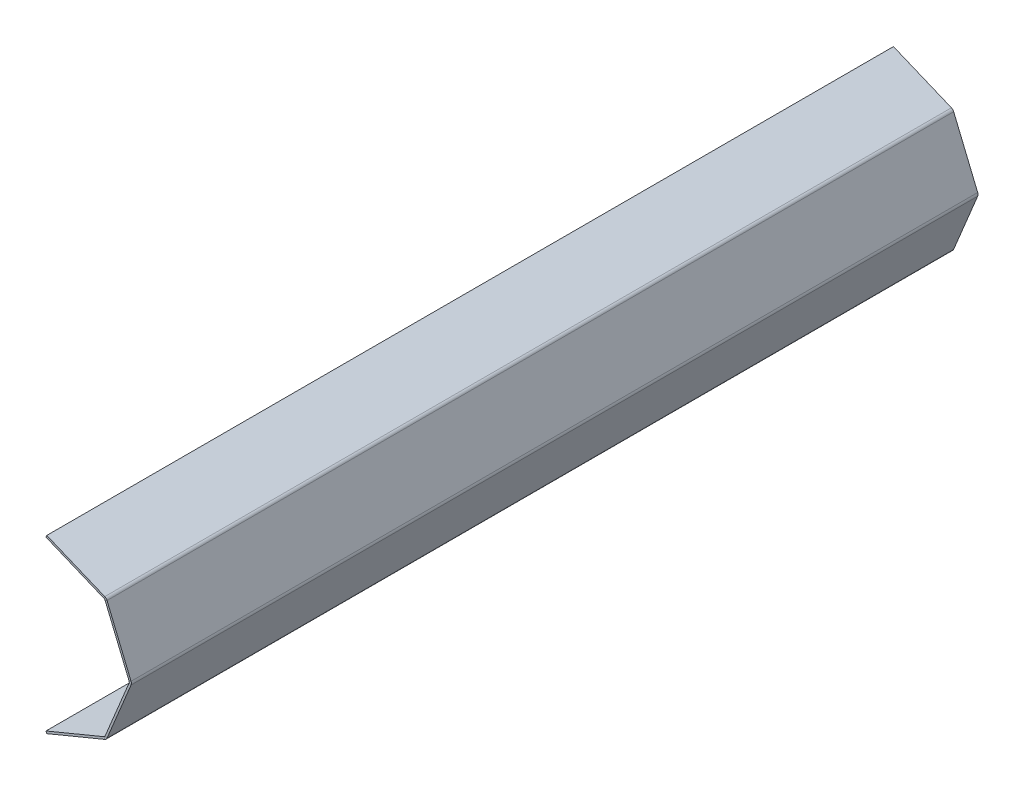
ISO-10303-21;
HEADER;
FILE_DESCRIPTION(('STEP AP214'),'2;1');
FILE_NAME('part.step','',(''),(''),'','','');
FILE_SCHEMA(('AUTOMOTIVE_DESIGN { 1 0 10303 214 1 1 1 1 }'));
ENDSEC;
DATA;
#1=APPLICATION_CONTEXT('core data for automotive mechanical design processes');
#2=APPLICATION_PROTOCOL_DEFINITION('international standard','automotive_design',2000,#1);
#3=PRODUCT_CONTEXT('',#1,'mechanical');
#4=PRODUCT('Part','Part','',(#3));
#5=PRODUCT_RELATED_PRODUCT_CATEGORY('part','',(#4));
#6=PRODUCT_DEFINITION_FORMATION('','',#4);
#7=PRODUCT_DEFINITION_CONTEXT('part definition',#1,'design');
#8=PRODUCT_DEFINITION('design','',#6,#7);
#9=PRODUCT_DEFINITION_SHAPE('','',#8);
#10=(LENGTH_UNIT() NAMED_UNIT(*) SI_UNIT(.MILLI.,.METRE.));
#11=(NAMED_UNIT(*) PLANE_ANGLE_UNIT() SI_UNIT($,.RADIAN.));
#12=(NAMED_UNIT(*) SI_UNIT($,.STERADIAN.) SOLID_ANGLE_UNIT());
#13=UNCERTAINTY_MEASURE_WITH_UNIT(LENGTH_MEASURE(1.E-05),#10,'distance_accuracy_value','');
#14=(GEOMETRIC_REPRESENTATION_CONTEXT(3) GLOBAL_UNCERTAINTY_ASSIGNED_CONTEXT((#13)) GLOBAL_UNIT_ASSIGNED_CONTEXT((#10,
#11,#12)) REPRESENTATION_CONTEXT('',''));
#15=CARTESIAN_POINT('',(0.,0.,0.));
#16=DIRECTION('',(0.,0.,1.));
#17=DIRECTION('',(1.,0.,0.));
#18=AXIS2_PLACEMENT_3D('',#15,#16,#17);
#19=CARTESIAN_POINT('',(139.507939075484,142.213919576215,2010.));
#20=DIRECTION('',(0.,0.,1.));
#21=DIRECTION('',(1.,0.,0.));
#22=AXIS2_PLACEMENT_3D('',#19,#20,#21);
#23=PLANE('',#22);
#24=DIRECTION('',(0.382683432365087,0.923879532511288,0.));
#25=VECTOR('',#24,1.);
#26=CARTESIAN_POINT('',(139.507939075484,142.213919576215,2010.));
#27=LINE('',#26,#25);
#28=CARTESIAN_POINT('',(139.507939075484,142.213919576215,2010.));
#29=VERTEX_POINT('',#28);
#30=CARTESIAN_POINT('',(141.42135623731,146.833317238771,2010.));
#31=VERTEX_POINT('',#30);
#32=EDGE_CURVE('E11',#29,#31,#27,.T.);
#33=ORIENTED_EDGE('',*,*,#32,.F.);
#34=CARTESIAN_POINT('',(137.594521913659,137.594521913659,2010.));
#35=DIRECTION('',(0.,0.,1.));
#36=DIRECTION('',(1.,0.,0.));
#37=AXIS2_PLACEMENT_3D('',#34,#35,#36);
#38=CIRCLE('',#37,5.);
#39=CARTESIAN_POINT('',(142.213919576215,139.507939075484,2010.));
#40=VERTEX_POINT('',#39);
#41=EDGE_CURVE('E305',#29,#40,#38,.F.);
#42=ORIENTED_EDGE('',*,*,#41,.T.);
#43=DIRECTION('',(-0.923879532511283,-0.382683432365099,0.));
#44=VECTOR('',#43,1.);
#45=CARTESIAN_POINT('',(146.833317238772,141.42135623731,2010.));
#46=LINE('',#45,#44);
#47=CARTESIAN_POINT('',(146.833317238772,141.42135623731,2010.));
#48=VERTEX_POINT('',#47);
#49=EDGE_CURVE('E46',#48,#40,#46,.T.);
#50=ORIENTED_EDGE('',*,*,#49,.F.);
#51=CARTESIAN_POINT('',(137.594521913659,137.594521913659,2010.));
#52=DIRECTION('',(0.,0.,1.));
#53=DIRECTION('',(1.,0.,0.));
#54=AXIS2_PLACEMENT_3D('',#51,#52,#53);
#55=CIRCLE('',#54,10.);
#56=EDGE_CURVE('E324',#31,#48,#55,.F.);
#57=ORIENTED_EDGE('',*,*,#56,.F.);
#58=EDGE_LOOP('',(#33,#42,#50,#57));
#59=FACE_BOUND('',#58,.T.);
#60=ADVANCED_FACE('F38',(#59),#23,.T.);
#61=CARTESIAN_POINT('',(146.833317238772,141.42135623731,2010.));
#62=DIRECTION('',(0.,0.,1.));
#63=DIRECTION('',(1.,0.,0.));
#64=AXIS2_PLACEMENT_3D('',#61,#62,#63);
#65=PLANE('',#64);
#66=DIRECTION('',(0.923879532511287,-0.38268343236509,0.));
#67=VECTOR('',#66,1.);
#68=CARTESIAN_POINT('',(1.91341716182544,199.207436661095,2010.));
#69=LINE('',#68,#67);
#70=CARTESIAN_POINT('',(1.91341716182544,199.207436661095,2010.));
#71=VERTEX_POINT('',#70);
#72=EDGE_CURVE('E309',#71,#29,#69,.T.);
#73=ORIENTED_EDGE('',*,*,#72,.T.);
#74=ORIENTED_EDGE('',*,*,#32,.T.);
#75=DIRECTION('',(0.923879532511287,-0.38268343236509,0.));
#76=VECTOR('',#75,1.);
#77=CARTESIAN_POINT('',(3.82683432365089,203.826834323651,2010.));
#78=LINE('',#77,#76);
#79=CARTESIAN_POINT('',(3.82683432365089,203.826834323651,2010.));
#80=VERTEX_POINT('',#79);
#81=EDGE_CURVE('E321',#80,#31,#78,.T.);
#82=ORIENTED_EDGE('',*,*,#81,.F.);
#83=DIRECTION('',(0.382683432365091,0.923879532511286,0.));
#84=VECTOR('',#83,1.);
#85=CARTESIAN_POINT('',(1.91341716182544,199.207436661095,2010.));
#86=LINE('',#85,#84);
#87=EDGE_CURVE('E318',#71,#80,#86,.T.);
#88=ORIENTED_EDGE('',*,*,#87,.F.);
#89=EDGE_LOOP('',(#73,#74,#82,#88));
#90=FACE_BOUND('',#89,.T.);
#91=ADVANCED_FACE('F374',(#90),#65,.T.);
#92=CARTESIAN_POINT('',(142.213919576215,139.507939075484,0.));
#93=DIRECTION('',(0.,0.,-1.));
#94=DIRECTION('',(-1.,0.,0.));
#95=AXIS2_PLACEMENT_3D('',#92,#93,#94);
#96=PLANE('',#95);
#97=DIRECTION('',(0.923879532511283,0.382683432365099,0.));
#98=VECTOR('',#97,1.);
#99=CARTESIAN_POINT('',(142.213919576215,139.507939075484,0.));
#100=LINE('',#99,#98);
#101=CARTESIAN_POINT('',(142.213919576215,139.507939075484,0.));
#102=VERTEX_POINT('',#101);
#103=CARTESIAN_POINT('',(146.833317238772,141.42135623731,0.));
#104=VERTEX_POINT('',#103);
#105=EDGE_CURVE('E291',#102,#104,#100,.T.);
#106=ORIENTED_EDGE('',*,*,#105,.F.);
#107=CARTESIAN_POINT('',(137.594521913659,137.594521913659,0.));
#108=DIRECTION('',(0.,0.,1.));
#109=DIRECTION('',(1.,0.,0.));
#110=AXIS2_PLACEMENT_3D('',#107,#108,#109);
#111=CIRCLE('',#110,5.);
#112=CARTESIAN_POINT('',(139.507939075484,142.213919576215,0.));
#113=VERTEX_POINT('',#112);
#114=EDGE_CURVE('E233',#113,#102,#111,.F.);
#115=ORIENTED_EDGE('',*,*,#114,.F.);
#116=DIRECTION('',(-0.382683432365087,-0.923879532511288,0.));
#117=VECTOR('',#116,1.);
#118=CARTESIAN_POINT('',(141.42135623731,146.833317238771,0.));
#119=LINE('',#118,#117);
#120=CARTESIAN_POINT('',(141.42135623731,146.833317238771,0.));
#121=VERTEX_POINT('',#120);
#122=EDGE_CURVE('E289',#121,#113,#119,.T.);
#123=ORIENTED_EDGE('',*,*,#122,.F.);
#124=CARTESIAN_POINT('',(137.594521913659,137.594521913659,0.));
#125=DIRECTION('',(0.,0.,1.));
#126=DIRECTION('',(1.,0.,0.));
#127=AXIS2_PLACEMENT_3D('',#124,#125,#126);
#128=CIRCLE('',#127,10.);
#129=EDGE_CURVE('E221',#121,#104,#128,.F.);
#130=ORIENTED_EDGE('',*,*,#129,.T.);
#131=EDGE_LOOP('',(#106,#115,#123,#130));
#132=FACE_BOUND('',#131,.T.);
#133=ADVANCED_FACE('F384',(#132),#96,.T.);
#134=CARTESIAN_POINT('',(141.42135623731,146.833317238771,0.));
#135=DIRECTION('',(0.,0.,-1.));
#136=DIRECTION('',(-1.,0.,0.));
#137=AXIS2_PLACEMENT_3D('',#134,#135,#136);
#138=PLANE('',#137);
#139=DIRECTION('',(0.38268343236509,-0.923879532511287,0.));
#140=VECTOR('',#139,1.);
#141=CARTESIAN_POINT('',(200.,0.,0.));
#142=LINE('',#141,#140);
#143=CARTESIAN_POINT('',(199.207436661095,1.91341716182545,0.));
#144=VERTEX_POINT('',#143);
#145=EDGE_CURVE('E236',#102,#144,#142,.T.);
#146=ORIENTED_EDGE('',*,*,#145,.F.);
#147=ORIENTED_EDGE('',*,*,#105,.T.);
#148=DIRECTION('',(0.38268343236509,-0.923879532511287,0.));
#149=VECTOR('',#148,1.);
#150=CARTESIAN_POINT('',(204.619397662556,1.91341716182546,0.));
#151=LINE('',#150,#149);
#152=CARTESIAN_POINT('',(203.826834323651,3.82683432365091,0.));
#153=VERTEX_POINT('',#152);
#154=EDGE_CURVE('E218',#104,#153,#151,.T.);
#155=ORIENTED_EDGE('',*,*,#154,.T.);
#156=DIRECTION('',(-0.923879532511287,-0.38268343236509,0.));
#157=VECTOR('',#156,1.);
#158=CARTESIAN_POINT('',(203.826834323651,3.82683432365091,0.));
#159=LINE('',#158,#157);
#160=EDGE_CURVE('E285',#153,#144,#159,.T.);
#161=ORIENTED_EDGE('',*,*,#160,.T.);
#162=EDGE_LOOP('',(#146,#147,#155,#161));
#163=FACE_BOUND('',#162,.T.);
#164=ADVANCED_FACE('F386',(#163),#138,.T.);
#165=CARTESIAN_POINT('',(199.207436661095,1.91341716182545,2010.));
#166=DIRECTION('',(0.,0.,1.));
#167=DIRECTION('',(1.,0.,0.));
#168=AXIS2_PLACEMENT_3D('',#165,#166,#167);
#169=PLANE('',#168);
#170=DIRECTION('',(0.923879532511287,0.38268343236509,0.));
#171=VECTOR('',#170,1.);
#172=CARTESIAN_POINT('',(199.207436661095,1.91341716182545,2010.));
#173=LINE('',#172,#171);
#174=CARTESIAN_POINT('',(199.207436661095,1.91341716182545,2010.));
#175=VERTEX_POINT('',#174);
#176=CARTESIAN_POINT('',(203.826834323651,3.82683432365091,2010.));
#177=VERTEX_POINT('',#176);
#178=EDGE_CURVE('E171',#175,#177,#173,.T.);
#179=ORIENTED_EDGE('',*,*,#178,.F.);
#180=CARTESIAN_POINT('',(194.588038998538,0.,2010.));
#181=DIRECTION('',(0.,0.,1.));
#182=DIRECTION('',(1.,0.,0.));
#183=AXIS2_PLACEMENT_3D('',#180,#181,#182);
#184=CIRCLE('',#183,5.);
#185=CARTESIAN_POINT('',(199.207436661094,-1.9134171618255,2010.));
#186=VERTEX_POINT('',#185);
#187=EDGE_CURVE('E175',#175,#186,#184,.F.);
#188=ORIENTED_EDGE('',*,*,#187,.T.);
#189=DIRECTION('',(-0.923879532511287,0.382683432365089,0.));
#190=VECTOR('',#189,1.);
#191=CARTESIAN_POINT('',(203.826834323651,-3.82683432365094,2010.));
#192=LINE('',#191,#190);
#193=CARTESIAN_POINT('',(203.826834323651,-3.82683432365094,2010.));
#194=VERTEX_POINT('',#193);
#195=EDGE_CURVE('E159',#194,#186,#192,.T.);
#196=ORIENTED_EDGE('',*,*,#195,.F.);
#197=CARTESIAN_POINT('',(194.588038998538,0.,2010.));
#198=DIRECTION('',(0.,0.,1.));
#199=DIRECTION('',(1.,0.,0.));
#200=AXIS2_PLACEMENT_3D('',#197,#198,#199);
#201=CIRCLE('',#200,10.);
#202=EDGE_CURVE('E327',#177,#194,#201,.F.);
#203=ORIENTED_EDGE('',*,*,#202,.F.);
#204=EDGE_LOOP('',(#179,#188,#196,#203));
#205=FACE_BOUND('',#204,.T.);
#206=ADVANCED_FACE('F177',(#205),#169,.T.);
#207=CARTESIAN_POINT('',(203.826834323651,-3.82683432365094,2010.));
#208=DIRECTION('',(0.,0.,1.));
#209=DIRECTION('',(1.,0.,0.));
#210=AXIS2_PLACEMENT_3D('',#207,#208,#209);
#211=PLANE('',#210);
#212=DIRECTION('',(0.38268343236509,-0.923879532511287,0.));
#213=VECTOR('',#212,1.);
#214=CARTESIAN_POINT('',(200.,0.,2010.));
#215=LINE('',#214,#213);
#216=EDGE_CURVE('E181',#40,#175,#215,.T.);
#217=ORIENTED_EDGE('',*,*,#216,.T.);
#218=ORIENTED_EDGE('',*,*,#178,.T.);
#219=DIRECTION('',(0.38268343236509,-0.923879532511287,0.));
#220=VECTOR('',#219,1.);
#221=CARTESIAN_POINT('',(204.619397662556,1.91341716182546,2010.));
#222=LINE('',#221,#220);
#223=EDGE_CURVE('E299',#48,#177,#222,.T.);
#224=ORIENTED_EDGE('',*,*,#223,.F.);
#225=ORIENTED_EDGE('',*,*,#49,.T.);
#226=EDGE_LOOP('',(#217,#218,#224,#225));
#227=FACE_BOUND('',#226,.T.);
#228=ADVANCED_FACE('F295',(#227),#211,.T.);
#229=CARTESIAN_POINT('',(199.207436661094,-1.9134171618255,0.));
#230=DIRECTION('',(0.,0.,-1.));
#231=DIRECTION('',(-1.,0.,0.));
#232=AXIS2_PLACEMENT_3D('',#229,#230,#231);
#233=PLANE('',#232);
#234=DIRECTION('',(0.923879532511287,-0.382683432365089,0.));
#235=VECTOR('',#234,1.);
#236=CARTESIAN_POINT('',(199.207436661094,-1.9134171618255,0.));
#237=LINE('',#236,#235);
#238=CARTESIAN_POINT('',(199.207436661094,-1.9134171618255,0.));
#239=VERTEX_POINT('',#238);
#240=CARTESIAN_POINT('',(203.826834323651,-3.82683432365094,0.));
#241=VERTEX_POINT('',#240);
#242=EDGE_CURVE('E172',#239,#241,#237,.T.);
#243=ORIENTED_EDGE('',*,*,#242,.F.);
#244=CARTESIAN_POINT('',(194.588038998538,0.,0.));
#245=DIRECTION('',(0.,0.,1.));
#246=DIRECTION('',(1.,0.,0.));
#247=AXIS2_PLACEMENT_3D('',#244,#245,#246);
#248=CIRCLE('',#247,5.);
#249=EDGE_CURVE('E188',#144,#239,#248,.F.);
#250=ORIENTED_EDGE('',*,*,#249,.F.);
#251=ORIENTED_EDGE('',*,*,#160,.F.);
#252=CARTESIAN_POINT('',(194.588038998538,0.,0.));
#253=DIRECTION('',(0.,0.,1.));
#254=DIRECTION('',(1.,0.,0.));
#255=AXIS2_PLACEMENT_3D('',#252,#253,#254);
#256=CIRCLE('',#255,10.);
#257=EDGE_CURVE('E215',#153,#241,#256,.F.);
#258=ORIENTED_EDGE('',*,*,#257,.T.);
#259=EDGE_LOOP('',(#243,#250,#251,#258));
#260=FACE_BOUND('',#259,.T.);
#261=ADVANCED_FACE('F388',(#260),#233,.T.);
#262=CARTESIAN_POINT('',(203.826834323651,3.82683432365091,0.));
#263=DIRECTION('',(0.,0.,-1.));
#264=DIRECTION('',(-1.,0.,0.));
#265=AXIS2_PLACEMENT_3D('',#262,#263,#264);
#266=PLANE('',#265);
#267=DIRECTION('',(-0.38268343236509,-0.923879532511287,0.));
#268=VECTOR('',#267,1.);
#269=CARTESIAN_POINT('',(141.42135623731,-141.42135623731,0.));
#270=LINE('',#269,#268);
#271=CARTESIAN_POINT('',(142.213919576215,-139.507939075484,0.));
#272=VERTEX_POINT('',#271);
#273=EDGE_CURVE('E240',#239,#272,#270,.T.);
#274=ORIENTED_EDGE('',*,*,#273,.F.);
#275=ORIENTED_EDGE('',*,*,#242,.T.);
#276=DIRECTION('',(-0.38268343236509,-0.923879532511287,0.));
#277=VECTOR('',#276,1.);
#278=CARTESIAN_POINT('',(146.040753899866,-143.334773399135,0.));
#279=LINE('',#278,#277);
#280=CARTESIAN_POINT('',(146.833317238772,-141.42135623731,0.));
#281=VERTEX_POINT('',#280);
#282=EDGE_CURVE('E213',#241,#281,#279,.T.);
#283=ORIENTED_EDGE('',*,*,#282,.T.);
#284=DIRECTION('',(-0.923879532511288,0.382683432365087,0.));
#285=VECTOR('',#284,1.);
#286=CARTESIAN_POINT('',(146.833317238772,-141.42135623731,0.));
#287=LINE('',#286,#285);
#288=EDGE_CURVE('E107',#281,#272,#287,.T.);
#289=ORIENTED_EDGE('',*,*,#288,.T.);
#290=EDGE_LOOP('',(#274,#275,#283,#289));
#291=FACE_BOUND('',#290,.T.);
#292=ADVANCED_FACE('F389',(#291),#266,.T.);
#293=CARTESIAN_POINT('',(142.213919576215,-139.507939075484,2010.));
#294=DIRECTION('',(0.,0.,1.));
#295=DIRECTION('',(1.,0.,0.));
#296=AXIS2_PLACEMENT_3D('',#293,#294,#295);
#297=PLANE('',#296);
#298=DIRECTION('',(0.923879532511288,-0.382683432365087,0.));
#299=VECTOR('',#298,1.);
#300=CARTESIAN_POINT('',(142.213919576215,-139.507939075484,2010.));
#301=LINE('',#300,#299);
#302=CARTESIAN_POINT('',(142.213919576215,-139.507939075484,2010.));
#303=VERTEX_POINT('',#302);
#304=CARTESIAN_POINT('',(146.833317238772,-141.42135623731,2010.));
#305=VERTEX_POINT('',#304);
#306=EDGE_CURVE('E283',#303,#305,#301,.T.);
#307=ORIENTED_EDGE('',*,*,#306,.F.);
#308=CARTESIAN_POINT('',(137.594521913659,-137.594521913659,2010.));
#309=DIRECTION('',(0.,0.,1.));
#310=DIRECTION('',(1.,0.,0.));
#311=AXIS2_PLACEMENT_3D('',#308,#309,#310);
#312=CIRCLE('',#311,5.);
#313=CARTESIAN_POINT('',(139.507939075484,-142.213919576215,2010.));
#314=VERTEX_POINT('',#313);
#315=EDGE_CURVE('E196',#303,#314,#312,.F.);
#316=ORIENTED_EDGE('',*,*,#315,.T.);
#317=DIRECTION('',(-0.382683432365089,0.923879532511287,0.));
#318=VECTOR('',#317,1.);
#319=CARTESIAN_POINT('',(141.42135623731,-146.833317238772,2010.));
#320=LINE('',#319,#318);
#321=CARTESIAN_POINT('',(141.42135623731,-146.833317238772,2010.));
#322=VERTEX_POINT('',#321);
#323=EDGE_CURVE('E54',#322,#314,#320,.T.);
#324=ORIENTED_EDGE('',*,*,#323,.F.);
#325=CARTESIAN_POINT('',(137.594521913659,-137.594521913659,2010.));
#326=DIRECTION('',(0.,0.,1.));
#327=DIRECTION('',(1.,0.,0.));
#328=AXIS2_PLACEMENT_3D('',#325,#326,#327);
#329=CIRCLE('',#328,10.);
#330=EDGE_CURVE('E330',#305,#322,#329,.F.);
#331=ORIENTED_EDGE('',*,*,#330,.F.);
#332=EDGE_LOOP('',(#307,#316,#324,#331));
#333=FACE_BOUND('',#332,.T.);
#334=ADVANCED_FACE('F353',(#333),#297,.T.);
#335=CARTESIAN_POINT('',(141.42135623731,-146.833317238772,2010.));
#336=DIRECTION('',(0.,0.,1.));
#337=DIRECTION('',(1.,0.,0.));
#338=AXIS2_PLACEMENT_3D('',#335,#336,#337);
#339=PLANE('',#338);
#340=DIRECTION('',(-0.38268343236509,-0.923879532511287,0.));
#341=VECTOR('',#340,1.);
#342=CARTESIAN_POINT('',(141.42135623731,-141.42135623731,2010.));
#343=LINE('',#342,#341);
#344=EDGE_CURVE('E163',#186,#303,#343,.T.);
#345=ORIENTED_EDGE('',*,*,#344,.T.);
#346=ORIENTED_EDGE('',*,*,#306,.T.);
#347=DIRECTION('',(-0.38268343236509,-0.923879532511287,0.));
#348=VECTOR('',#347,1.);
#349=CARTESIAN_POINT('',(146.040753899866,-143.334773399135,2010.));
#350=LINE('',#349,#348);
#351=EDGE_CURVE('E166',#194,#305,#350,.T.);
#352=ORIENTED_EDGE('',*,*,#351,.F.);
#353=ORIENTED_EDGE('',*,*,#195,.T.);
#354=EDGE_LOOP('',(#345,#346,#352,#353));
#355=FACE_BOUND('',#354,.T.);
#356=ADVANCED_FACE('F161',(#355),#339,.T.);
#357=CARTESIAN_POINT('',(139.507939075484,-142.213919576215,0.));
#358=DIRECTION('',(0.,0.,-1.));
#359=DIRECTION('',(-1.,0.,0.));
#360=AXIS2_PLACEMENT_3D('',#357,#358,#359);
#361=PLANE('',#360);
#362=DIRECTION('',(0.382683432365089,-0.923879532511287,0.));
#363=VECTOR('',#362,1.);
#364=CARTESIAN_POINT('',(139.507939075484,-142.213919576215,0.));
#365=LINE('',#364,#363);
#366=CARTESIAN_POINT('',(139.507939075484,-142.213919576215,0.));
#367=VERTEX_POINT('',#366);
#368=CARTESIAN_POINT('',(141.42135623731,-146.833317238772,0.));
#369=VERTEX_POINT('',#368);
#370=EDGE_CURVE('E114',#367,#369,#365,.T.);
#371=ORIENTED_EDGE('',*,*,#370,.F.);
#372=CARTESIAN_POINT('',(137.594521913659,-137.594521913659,0.));
#373=DIRECTION('',(0.,0.,1.));
#374=DIRECTION('',(1.,0.,0.));
#375=AXIS2_PLACEMENT_3D('',#372,#373,#374);
#376=CIRCLE('',#375,5.);
#377=EDGE_CURVE('E242',#272,#367,#376,.F.);
#378=ORIENTED_EDGE('',*,*,#377,.F.);
#379=ORIENTED_EDGE('',*,*,#288,.F.);
#380=CARTESIAN_POINT('',(137.594521913659,-137.594521913659,0.));
#381=DIRECTION('',(0.,0.,1.));
#382=DIRECTION('',(1.,0.,0.));
#383=AXIS2_PLACEMENT_3D('',#380,#381,#382);
#384=CIRCLE('',#383,10.);
#385=EDGE_CURVE('E211',#281,#369,#384,.F.);
#386=ORIENTED_EDGE('',*,*,#385,.T.);
#387=EDGE_LOOP('',(#371,#378,#379,#386));
#388=FACE_BOUND('',#387,.T.);
#389=ADVANCED_FACE('F393',(#388),#361,.T.);
#390=CARTESIAN_POINT('',(146.833317238772,-141.42135623731,0.));
#391=DIRECTION('',(0.,0.,-1.));
#392=DIRECTION('',(-1.,0.,0.));
#393=AXIS2_PLACEMENT_3D('',#390,#391,#392);
#394=PLANE('',#393);
#395=DIRECTION('',(-0.923879532511287,-0.382683432365089,0.));
#396=VECTOR('',#395,1.);
#397=CARTESIAN_POINT('',(141.42135623731,-141.42135623731,0.));
#398=LINE('',#397,#396);
#399=CARTESIAN_POINT('',(1.91341716182541,-199.207436661094,0.));
#400=VERTEX_POINT('',#399);
#401=EDGE_CURVE('E202',#367,#400,#398,.T.);
#402=ORIENTED_EDGE('',*,*,#401,.F.);
#403=ORIENTED_EDGE('',*,*,#370,.T.);
#404=DIRECTION('',(-0.923879532511287,-0.382683432365089,0.));
#405=VECTOR('',#404,1.);
#406=CARTESIAN_POINT('',(143.334773399135,-146.040753899866,0.));
#407=LINE('',#406,#405);
#408=CARTESIAN_POINT('',(3.82683432365083,-203.826834323651,0.));
#409=VERTEX_POINT('',#408);
#410=EDGE_CURVE('E208',#369,#409,#407,.T.);
#411=ORIENTED_EDGE('',*,*,#410,.T.);
#412=DIRECTION('',(-0.382683432365086,0.923879532511288,0.));
#413=VECTOR('',#412,1.);
#414=CARTESIAN_POINT('',(3.82683432365083,-203.826834323651,0.));
#415=LINE('',#414,#413);
#416=EDGE_CURVE('E205',#409,#400,#415,.T.);
#417=ORIENTED_EDGE('',*,*,#416,.T.);
#418=EDGE_LOOP('',(#402,#403,#411,#417));
#419=FACE_BOUND('',#418,.T.);
#420=ADVANCED_FACE('F395',(#419),#394,.T.);
#421=CARTESIAN_POINT('',(141.42135623731,-141.42135623731,2010.));
#422=DIRECTION('',(0.382683432365089,-0.923879532511287,0.));
#423=DIRECTION('',(0.923879532511287,0.382683432365089,0.));
#424=AXIS2_PLACEMENT_3D('',#421,#422,#423);
#425=PLANE('',#424);
#426=ORIENTED_EDGE('',*,*,#401,.T.);
#427=DIRECTION('',(0.,0.,-1.));
#428=VECTOR('',#427,1.);
#429=CARTESIAN_POINT('',(1.91341716182541,-199.207436661094,2010.));
#430=LINE('',#429,#428);
#431=CARTESIAN_POINT('',(1.91341716182541,-199.207436661094,2010.));
#432=VERTEX_POINT('',#431);
#433=EDGE_CURVE('E278',#432,#400,#430,.T.);
#434=ORIENTED_EDGE('',*,*,#433,.F.);
#435=DIRECTION('',(-0.923879532511287,-0.382683432365089,0.));
#436=VECTOR('',#435,1.);
#437=CARTESIAN_POINT('',(141.42135623731,-141.42135623731,2010.));
#438=LINE('',#437,#436);
#439=EDGE_CURVE('E120',#314,#432,#438,.T.);
#440=ORIENTED_EDGE('',*,*,#439,.F.);
#441=DIRECTION('',(0.,0.,-1.));
#442=VECTOR('',#441,1.);
#443=CARTESIAN_POINT('',(139.507939075484,-142.213919576215,2010.));
#444=LINE('',#443,#442);
#445=EDGE_CURVE('E198',#314,#367,#444,.T.);
#446=ORIENTED_EDGE('',*,*,#445,.T.);
#447=EDGE_LOOP('',(#426,#434,#440,#446));
#448=FACE_BOUND('',#447,.T.);
#449=ADVANCED_FACE('F401',(#448),#425,.F.);
#450=CARTESIAN_POINT('',(3.82683432365083,-203.826834323651,2010.));
#451=DIRECTION('',(-0.923879532511288,-0.382683432365086,0.));
#452=DIRECTION('',(0.382683432365086,-0.923879532511288,0.));
#453=AXIS2_PLACEMENT_3D('',#450,#451,#452);
#454=PLANE('',#453);
#455=ORIENTED_EDGE('',*,*,#416,.F.);
#456=DIRECTION('',(0.,0.,-1.));
#457=VECTOR('',#456,1.);
#458=CARTESIAN_POINT('',(3.82683432365083,-203.826834323651,2010.));
#459=LINE('',#458,#457);
#460=CARTESIAN_POINT('',(3.82683432365083,-203.826834323651,2010.));
#461=VERTEX_POINT('',#460);
#462=EDGE_CURVE('E276',#461,#409,#459,.T.);
#463=ORIENTED_EDGE('',*,*,#462,.F.);
#464=DIRECTION('',(-0.382683432365086,0.923879532511288,0.));
#465=VECTOR('',#464,1.);
#466=CARTESIAN_POINT('',(3.82683432365083,-203.826834323651,2010.));
#467=LINE('',#466,#465);
#468=EDGE_CURVE('E336',#461,#432,#467,.T.);
#469=ORIENTED_EDGE('',*,*,#468,.T.);
#470=ORIENTED_EDGE('',*,*,#433,.T.);
#471=EDGE_LOOP('',(#455,#463,#469,#470));
#472=FACE_BOUND('',#471,.T.);
#473=ADVANCED_FACE('F341',(#472),#454,.T.);
#474=CARTESIAN_POINT('',(143.334773399135,-146.040753899866,2010.));
#475=DIRECTION('',(0.382683432365089,-0.923879532511287,0.));
#476=DIRECTION('',(0.923879532511287,0.382683432365089,0.));
#477=AXIS2_PLACEMENT_3D('',#474,#475,#476);
#478=PLANE('',#477);
#479=ORIENTED_EDGE('',*,*,#410,.F.);
#480=DIRECTION('',(0.,0.,-1.));
#481=VECTOR('',#480,1.);
#482=CARTESIAN_POINT('',(141.42135623731,-146.833317238772,2010.));
#483=LINE('',#482,#481);
#484=EDGE_CURVE('E273',#322,#369,#483,.T.);
#485=ORIENTED_EDGE('',*,*,#484,.F.);
#486=DIRECTION('',(-0.923879532511287,-0.382683432365089,0.));
#487=VECTOR('',#486,1.);
#488=CARTESIAN_POINT('',(143.334773399135,-146.040753899866,2010.));
#489=LINE('',#488,#487);
#490=EDGE_CURVE('E333',#322,#461,#489,.T.);
#491=ORIENTED_EDGE('',*,*,#490,.T.);
#492=ORIENTED_EDGE('',*,*,#462,.T.);
#493=EDGE_LOOP('',(#479,#485,#491,#492));
#494=FACE_BOUND('',#493,.T.);
#495=ADVANCED_FACE('F346',(#494),#478,.T.);
#496=CARTESIAN_POINT('',(137.594521913659,-137.594521913659,2010.));
#497=DIRECTION('',(0.,0.,-1.));
#498=DIRECTION('',(-1.,0.,0.));
#499=AXIS2_PLACEMENT_3D('',#496,#497,#498);
#500=CYLINDRICAL_SURFACE('',#499,10.);
#501=ORIENTED_EDGE('',*,*,#385,.F.);
#502=DIRECTION('',(0.,0.,-1.));
#503=VECTOR('',#502,1.);
#504=CARTESIAN_POINT('',(146.833317238772,-141.42135623731,2010.));
#505=LINE('',#504,#503);
#506=EDGE_CURVE('E270',#305,#281,#505,.T.);
#507=ORIENTED_EDGE('',*,*,#506,.F.);
#508=ORIENTED_EDGE('',*,*,#330,.T.);
#509=ORIENTED_EDGE('',*,*,#484,.T.);
#510=EDGE_LOOP('',(#501,#507,#508,#509));
#511=FACE_BOUND('',#510,.T.);
#512=ADVANCED_FACE('F349',(#511),#500,.T.);
#513=CARTESIAN_POINT('',(146.040753899866,-143.334773399135,2010.));
#514=DIRECTION('',(0.923879532511287,-0.38268343236509,0.));
#515=DIRECTION('',(0.38268343236509,0.923879532511287,0.));
#516=AXIS2_PLACEMENT_3D('',#513,#514,#515);
#517=PLANE('',#516);
#518=ORIENTED_EDGE('',*,*,#282,.F.);
#519=DIRECTION('',(0.,0.,-1.));
#520=VECTOR('',#519,1.);
#521=CARTESIAN_POINT('',(203.826834323651,-3.82683432365094,2010.));
#522=LINE('',#521,#520);
#523=EDGE_CURVE('E267',#194,#241,#522,.T.);
#524=ORIENTED_EDGE('',*,*,#523,.F.);
#525=ORIENTED_EDGE('',*,*,#351,.T.);
#526=ORIENTED_EDGE('',*,*,#506,.T.);
#527=EDGE_LOOP('',(#518,#524,#525,#526));
#528=FACE_BOUND('',#527,.T.);
#529=ADVANCED_FACE('F356',(#528),#517,.T.);
#530=CARTESIAN_POINT('',(194.588038998538,0.,2010.));
#531=DIRECTION('',(0.,0.,-1.));
#532=DIRECTION('',(-1.,0.,0.));
#533=AXIS2_PLACEMENT_3D('',#530,#531,#532);
#534=CYLINDRICAL_SURFACE('',#533,10.);
#535=ORIENTED_EDGE('',*,*,#257,.F.);
#536=DIRECTION('',(0.,0.,-1.));
#537=VECTOR('',#536,1.);
#538=CARTESIAN_POINT('',(203.826834323651,3.82683432365091,2010.));
#539=LINE('',#538,#537);
#540=EDGE_CURVE('E264',#177,#153,#539,.T.);
#541=ORIENTED_EDGE('',*,*,#540,.F.);
#542=ORIENTED_EDGE('',*,*,#202,.T.);
#543=ORIENTED_EDGE('',*,*,#523,.T.);
#544=EDGE_LOOP('',(#535,#541,#542,#543));
#545=FACE_BOUND('',#544,.T.);
#546=ADVANCED_FACE('F359',(#545),#534,.T.);
#547=CARTESIAN_POINT('',(204.619397662556,1.91341716182546,2010.));
#548=DIRECTION('',(0.923879532511287,0.38268343236509,0.));
#549=DIRECTION('',(-0.38268343236509,0.923879532511287,0.));
#550=AXIS2_PLACEMENT_3D('',#547,#548,#549);
#551=PLANE('',#550);
#552=ORIENTED_EDGE('',*,*,#154,.F.);
#553=DIRECTION('',(0.,0.,-1.));
#554=VECTOR('',#553,1.);
#555=CARTESIAN_POINT('',(146.833317238772,141.42135623731,2010.));
#556=LINE('',#555,#554);
#557=EDGE_CURVE('E261',#48,#104,#556,.T.);
#558=ORIENTED_EDGE('',*,*,#557,.F.);
#559=ORIENTED_EDGE('',*,*,#223,.T.);
#560=ORIENTED_EDGE('',*,*,#540,.T.);
#561=EDGE_LOOP('',(#552,#558,#559,#560));
#562=FACE_BOUND('',#561,.T.);
#563=ADVANCED_FACE('F363',(#562),#551,.T.);
#564=CARTESIAN_POINT('',(137.594521913659,137.594521913659,2010.));
#565=DIRECTION('',(0.,0.,-1.));
#566=DIRECTION('',(-1.,0.,0.));
#567=AXIS2_PLACEMENT_3D('',#564,#565,#566);
#568=CYLINDRICAL_SURFACE('',#567,10.);
#569=ORIENTED_EDGE('',*,*,#129,.F.);
#570=DIRECTION('',(0.,0.,-1.));
#571=VECTOR('',#570,1.);
#572=CARTESIAN_POINT('',(141.42135623731,146.833317238771,2010.));
#573=LINE('',#572,#571);
#574=EDGE_CURVE('E258',#31,#121,#573,.T.);
#575=ORIENTED_EDGE('',*,*,#574,.F.);
#576=ORIENTED_EDGE('',*,*,#56,.T.);
#577=ORIENTED_EDGE('',*,*,#557,.T.);
#578=EDGE_LOOP('',(#569,#575,#576,#577));
#579=FACE_BOUND('',#578,.T.);
#580=ADVANCED_FACE('F366',(#579),#568,.T.);
#581=CARTESIAN_POINT('',(3.82683432365089,203.826834323651,2010.));
#582=DIRECTION('',(0.38268343236509,0.923879532511287,0.));
#583=DIRECTION('',(-0.923879532511287,0.38268343236509,0.));
#584=AXIS2_PLACEMENT_3D('',#581,#582,#583);
#585=PLANE('',#584);
#586=DIRECTION('',(0.923879532511287,-0.38268343236509,0.));
#587=VECTOR('',#586,1.);
#588=CARTESIAN_POINT('',(3.82683432365089,203.826834323651,0.));
#589=LINE('',#588,#587);
#590=CARTESIAN_POINT('',(3.82683432365089,203.826834323651,0.));
#591=VERTEX_POINT('',#590);
#592=EDGE_CURVE('E224',#591,#121,#589,.T.);
#593=ORIENTED_EDGE('',*,*,#592,.F.);
#594=DIRECTION('',(0.,0.,-1.));
#595=VECTOR('',#594,1.);
#596=CARTESIAN_POINT('',(3.82683432365089,203.826834323651,2010.));
#597=LINE('',#596,#595);
#598=EDGE_CURVE('E256',#80,#591,#597,.T.);
#599=ORIENTED_EDGE('',*,*,#598,.F.);
#600=ORIENTED_EDGE('',*,*,#81,.T.);
#601=ORIENTED_EDGE('',*,*,#574,.T.);
#602=EDGE_LOOP('',(#593,#599,#600,#601));
#603=FACE_BOUND('',#602,.T.);
#604=ADVANCED_FACE('F371',(#603),#585,.T.);
#605=CARTESIAN_POINT('',(1.91341716182544,199.207436661095,2010.));
#606=DIRECTION('',(-0.923879532511287,0.382683432365091,0.));
#607=DIRECTION('',(-0.382683432365091,-0.923879532511287,0.));
#608=AXIS2_PLACEMENT_3D('',#605,#606,#607);
#609=PLANE('',#608);
#610=DIRECTION('',(0.382683432365091,0.923879532511286,0.));
#611=VECTOR('',#610,1.);
#612=CARTESIAN_POINT('',(1.91341716182544,199.207436661095,0.));
#613=LINE('',#612,#611);
#614=CARTESIAN_POINT('',(1.91341716182544,199.207436661095,0.));
#615=VERTEX_POINT('',#614);
#616=EDGE_CURVE('E227',#615,#591,#613,.T.);
#617=ORIENTED_EDGE('',*,*,#616,.F.);
#618=DIRECTION('',(0.,0.,-1.));
#619=VECTOR('',#618,1.);
#620=CARTESIAN_POINT('',(1.91341716182544,199.207436661095,2010.));
#621=LINE('',#620,#619);
#622=EDGE_CURVE('E254',#71,#615,#621,.T.);
#623=ORIENTED_EDGE('',*,*,#622,.F.);
#624=ORIENTED_EDGE('',*,*,#87,.T.);
#625=ORIENTED_EDGE('',*,*,#598,.T.);
#626=EDGE_LOOP('',(#617,#623,#624,#625));
#627=FACE_BOUND('',#626,.T.);
#628=ADVANCED_FACE('F377',(#627),#609,.T.);
#629=CARTESIAN_POINT('',(1.91341716182544,199.207436661095,2010.));
#630=DIRECTION('',(0.38268343236509,0.923879532511287,0.));
#631=DIRECTION('',(-0.923879532511287,0.38268343236509,0.));
#632=AXIS2_PLACEMENT_3D('',#629,#630,#631);
#633=PLANE('',#632);
#634=DIRECTION('',(0.923879532511287,-0.38268343236509,0.));
#635=VECTOR('',#634,1.);
#636=CARTESIAN_POINT('',(1.91341716182544,199.207436661095,0.));
#637=LINE('',#636,#635);
#638=EDGE_CURVE('E230',#615,#113,#637,.T.);
#639=ORIENTED_EDGE('',*,*,#638,.T.);
#640=DIRECTION('',(0.,0.,-1.));
#641=VECTOR('',#640,1.);
#642=CARTESIAN_POINT('',(139.507939075484,142.213919576215,2010.));
#643=LINE('',#642,#641);
#644=EDGE_CURVE('E251',#29,#113,#643,.T.);
#645=ORIENTED_EDGE('',*,*,#644,.F.);
#646=ORIENTED_EDGE('',*,*,#72,.F.);
#647=ORIENTED_EDGE('',*,*,#622,.T.);
#648=EDGE_LOOP('',(#639,#645,#646,#647));
#649=FACE_BOUND('',#648,.T.);
#650=ADVANCED_FACE('F382',(#649),#633,.F.);
#651=CARTESIAN_POINT('',(137.594521913659,137.594521913659,2010.));
#652=DIRECTION('',(0.,0.,-1.));
#653=DIRECTION('',(-1.,0.,0.));
#654=AXIS2_PLACEMENT_3D('',#651,#652,#653);
#655=CYLINDRICAL_SURFACE('',#654,5.);
#656=ORIENTED_EDGE('',*,*,#114,.T.);
#657=DIRECTION('',(0.,0.,-1.));
#658=VECTOR('',#657,1.);
#659=CARTESIAN_POINT('',(142.213919576215,139.507939075484,2010.));
#660=LINE('',#659,#658);
#661=EDGE_CURVE('E248',#40,#102,#660,.T.);
#662=ORIENTED_EDGE('',*,*,#661,.F.);
#663=ORIENTED_EDGE('',*,*,#41,.F.);
#664=ORIENTED_EDGE('',*,*,#644,.T.);
#665=EDGE_LOOP('',(#656,#662,#663,#664));
#666=FACE_BOUND('',#665,.T.);
#667=ADVANCED_FACE('F311',(#666),#655,.F.);
#668=CARTESIAN_POINT('',(200.,0.,2010.));
#669=DIRECTION('',(0.923879532511287,0.38268343236509,0.));
#670=DIRECTION('',(-0.38268343236509,0.923879532511287,0.));
#671=AXIS2_PLACEMENT_3D('',#668,#669,#670);
#672=PLANE('',#671);
#673=ORIENTED_EDGE('',*,*,#145,.T.);
#674=DIRECTION('',(0.,0.,-1.));
#675=VECTOR('',#674,1.);
#676=CARTESIAN_POINT('',(199.207436661095,1.91341716182545,2010.));
#677=LINE('',#676,#675);
#678=EDGE_CURVE('E190',#175,#144,#677,.T.);
#679=ORIENTED_EDGE('',*,*,#678,.F.);
#680=ORIENTED_EDGE('',*,*,#216,.F.);
#681=ORIENTED_EDGE('',*,*,#661,.T.);
#682=EDGE_LOOP('',(#673,#679,#680,#681));
#683=FACE_BOUND('',#682,.T.);
#684=ADVANCED_FACE('F315',(#683),#672,.F.);
#685=CARTESIAN_POINT('',(194.588038998538,0.,2010.));
#686=DIRECTION('',(0.,0.,-1.));
#687=DIRECTION('',(-1.,0.,0.));
#688=AXIS2_PLACEMENT_3D('',#685,#686,#687);
#689=CYLINDRICAL_SURFACE('',#688,5.);
#690=ORIENTED_EDGE('',*,*,#249,.T.);
#691=DIRECTION('',(0.,0.,-1.));
#692=VECTOR('',#691,1.);
#693=CARTESIAN_POINT('',(199.207436661094,-1.9134171618255,2010.));
#694=LINE('',#693,#692);
#695=EDGE_CURVE('E185',#186,#239,#694,.T.);
#696=ORIENTED_EDGE('',*,*,#695,.F.);
#697=ORIENTED_EDGE('',*,*,#187,.F.);
#698=ORIENTED_EDGE('',*,*,#678,.T.);
#699=EDGE_LOOP('',(#690,#696,#697,#698));
#700=FACE_BOUND('',#699,.T.);
#701=ADVANCED_FACE('F186',(#700),#689,.F.);
#702=CARTESIAN_POINT('',(141.42135623731,-141.42135623731,2010.));
#703=DIRECTION('',(0.923879532511287,-0.38268343236509,0.));
#704=DIRECTION('',(0.38268343236509,0.923879532511287,0.));
#705=AXIS2_PLACEMENT_3D('',#702,#703,#704);
#706=PLANE('',#705);
#707=ORIENTED_EDGE('',*,*,#273,.T.);
#708=DIRECTION('',(0.,0.,-1.));
#709=VECTOR('',#708,1.);
#710=CARTESIAN_POINT('',(142.213919576215,-139.507939075484,2010.));
#711=LINE('',#710,#709);
#712=EDGE_CURVE('E191',#303,#272,#711,.T.);
#713=ORIENTED_EDGE('',*,*,#712,.F.);
#714=ORIENTED_EDGE('',*,*,#344,.F.);
#715=ORIENTED_EDGE('',*,*,#695,.T.);
#716=EDGE_LOOP('',(#707,#713,#714,#715));
#717=FACE_BOUND('',#716,.T.);
#718=ADVANCED_FACE('F193',(#717),#706,.F.);
#719=CARTESIAN_POINT('',(137.594521913659,-137.594521913659,2010.));
#720=DIRECTION('',(0.,0.,-1.));
#721=DIRECTION('',(-1.,0.,0.));
#722=AXIS2_PLACEMENT_3D('',#719,#720,#721);
#723=CYLINDRICAL_SURFACE('',#722,5.);
#724=ORIENTED_EDGE('',*,*,#377,.T.);
#725=ORIENTED_EDGE('',*,*,#445,.F.);
#726=ORIENTED_EDGE('',*,*,#315,.F.);
#727=ORIENTED_EDGE('',*,*,#712,.T.);
#728=EDGE_LOOP('',(#724,#725,#726,#727));
#729=FACE_BOUND('',#728,.T.);
#730=ADVANCED_FACE('F391',(#729),#723,.F.);
#731=CARTESIAN_POINT('',(137.594521913659,-137.594521913659,2010.));
#732=DIRECTION('',(0.,0.,1.));
#733=DIRECTION('',(1.,0.,0.));
#734=AXIS2_PLACEMENT_3D('',#731,#732,#733);
#735=PLANE('',#734);
#736=ORIENTED_EDGE('',*,*,#439,.T.);
#737=ORIENTED_EDGE('',*,*,#468,.F.);
#738=ORIENTED_EDGE('',*,*,#490,.F.);
#739=ORIENTED_EDGE('',*,*,#323,.T.);
#740=EDGE_LOOP('',(#736,#737,#738,#739));
#741=FACE_BOUND('',#740,.T.);
#742=ADVANCED_FACE('F342',(#741),#735,.T.);
#743=CARTESIAN_POINT('',(137.594521913659,-137.594521913659,0.));
#744=DIRECTION('',(0.,0.,1.));
#745=DIRECTION('',(1.,0.,0.));
#746=AXIS2_PLACEMENT_3D('',#743,#744,#745);
#747=PLANE('',#746);
#748=ORIENTED_EDGE('',*,*,#592,.T.);
#749=ORIENTED_EDGE('',*,*,#122,.T.);
#750=ORIENTED_EDGE('',*,*,#638,.F.);
#751=ORIENTED_EDGE('',*,*,#616,.T.);
#752=EDGE_LOOP('',(#748,#749,#750,#751));
#753=FACE_BOUND('',#752,.T.);
#754=ADVANCED_FACE('F600',(#753),#747,.F.);
#755=CLOSED_SHELL('',(#60,#91,#133,#164,#206,#228,#261,#292,#334,#356,#389,#420,#449,#473,#495,
#512,#529,#546,#563,#580,#604,#628,#650,#667,#684,#701,#718,#730,#742,#754));
#756=MANIFOLD_SOLID_BREP('B2',#755);
#757=ADVANCED_BREP_SHAPE_REPRESENTATION('',(#18,#756),#14);
#758=SHAPE_DEFINITION_REPRESENTATION(#9,#757);
ENDSEC;
END-ISO-10303-21;
